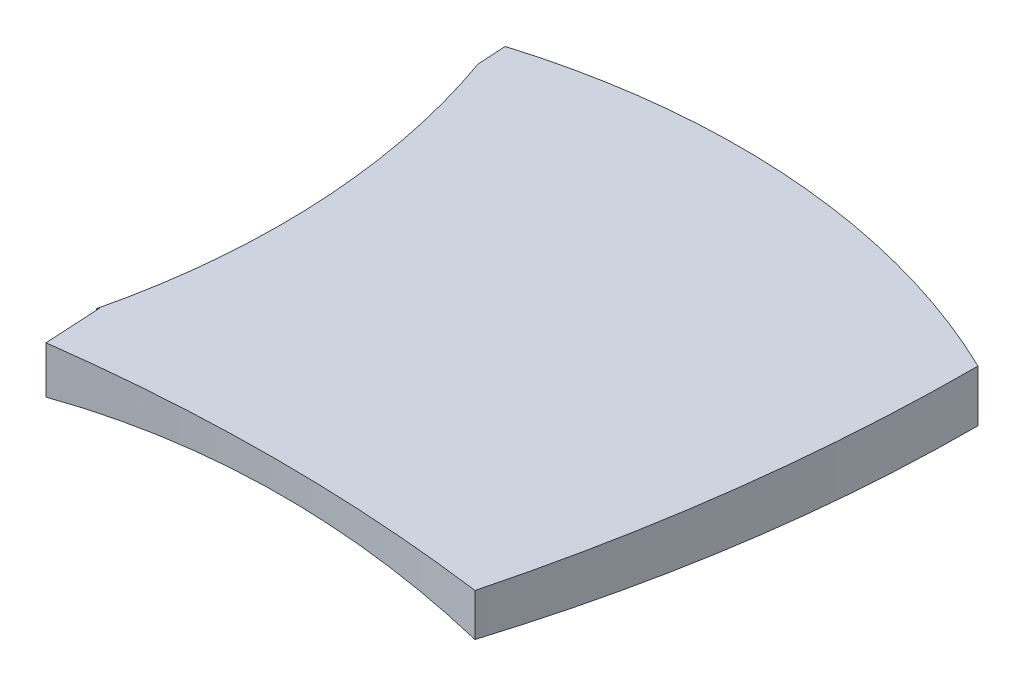
ISO-10303-21;
HEADER;
FILE_DESCRIPTION(('STEP AP214'),'2;1');
FILE_NAME('part.step','',(''),(''),'','','');
FILE_SCHEMA(('AUTOMOTIVE_DESIGN { 1 0 10303 214 1 1 1 1 }'));
ENDSEC;
DATA;
#1=APPLICATION_CONTEXT('core data for automotive mechanical design processes');
#2=APPLICATION_PROTOCOL_DEFINITION('international standard','automotive_design',2000,#1);
#3=PRODUCT_CONTEXT('',#1,'mechanical');
#4=PRODUCT('Part','Part','',(#3));
#5=PRODUCT_RELATED_PRODUCT_CATEGORY('part','',(#4));
#6=PRODUCT_DEFINITION_FORMATION('','',#4);
#7=PRODUCT_DEFINITION_CONTEXT('part definition',#1,'design');
#8=PRODUCT_DEFINITION('design','',#6,#7);
#9=PRODUCT_DEFINITION_SHAPE('','',#8);
#10=(LENGTH_UNIT() NAMED_UNIT(*) SI_UNIT(.MILLI.,.METRE.));
#11=(NAMED_UNIT(*) PLANE_ANGLE_UNIT() SI_UNIT($,.RADIAN.));
#12=(NAMED_UNIT(*) SI_UNIT($,.STERADIAN.) SOLID_ANGLE_UNIT());
#13=UNCERTAINTY_MEASURE_WITH_UNIT(LENGTH_MEASURE(1.E-05),#10,'distance_accuracy_value','');
#14=(GEOMETRIC_REPRESENTATION_CONTEXT(3) GLOBAL_UNCERTAINTY_ASSIGNED_CONTEXT((#13)) GLOBAL_UNIT_ASSIGNED_CONTEXT((#10,
#11,#12)) REPRESENTATION_CONTEXT('',''));
#15=CARTESIAN_POINT('',(0.,0.,0.));
#16=DIRECTION('',(0.,0.,1.));
#17=DIRECTION('',(1.,0.,0.));
#18=AXIS2_PLACEMENT_3D('',#15,#16,#17);
#19=CARTESIAN_POINT('',(-8.88859647248739,15.,78.1610309840222));
#20=DIRECTION('',(0.,-1.,0.));
#21=DIRECTION('',(0.,0.,-1.));
#22=AXIS2_PLACEMENT_3D('',#19,#20,#21);
#23=CYLINDRICAL_SURFACE('',#22,123.482500582783);
#24=DIRECTION('',(0.,-1.,0.));
#25=VECTOR('',#24,1.);
#26=CARTESIAN_POINT('',(45.,15.,-32.94228634));
#27=LINE('',#26,#25);
#28=CARTESIAN_POINT('',(45.,15.,-32.94228634));
#29=VERTEX_POINT('',#28);
#30=CARTESIAN_POINT('',(45.,5.96034980827603,-32.94228634));
#31=VERTEX_POINT('',#30);
#32=EDGE_CURVE('E61',#29,#31,#27,.T.);
#33=ORIENTED_EDGE('',*,*,#32,.T.);
#34=CARTESIAN_POINT('',(45.0000000000001,5.96034980827603,-32.9422863399999));
#35=CARTESIAN_POINT('',(43.5834184027266,6.21759089851168,-33.6293930770997));
#36=CARTESIAN_POINT('',(42.1521862624013,6.46486537990787,-34.2900995016351));
#37=CARTESIAN_POINT('',(39.2624221339613,6.93794334408272,-35.5574614845578));
#38=CARTESIAN_POINT('',(37.8038888298308,7.16374578862426,-36.1641144292087));
#39=CARTESIAN_POINT('',(34.8611849596405,7.59238606599919,-37.3222398739577));
#40=CARTESIAN_POINT('',(33.3770062513949,7.79521644505457,-37.8736944570605));
#41=CARTESIAN_POINT('',(30.3857431614198,8.17640697778323,-38.9199865031664));
#42=CARTESIAN_POINT('',(28.8786591219798,8.35476749672716,-39.4148248112834));
#43=CARTESIAN_POINT('',(25.8436086723789,8.68575380049673,-40.3468695304469));
#44=CARTESIAN_POINT('',(24.3156377636434,8.83837394390338,-40.7840633031927));
#45=CARTESIAN_POINT('',(21.2416607026515,9.11666250857526,-41.5996643493418));
#46=CARTESIAN_POINT('',(19.6956546672255,9.24233110432875,-41.9780720033307));
#47=CARTESIAN_POINT('',(16.5884586815512,9.46568095669588,-42.6751489159118));
#48=CARTESIAN_POINT('',(15.0272709605506,9.56336626002556,-42.9938268098292));
#49=CARTESIAN_POINT('',(11.8922389764383,9.72991442741941,-43.5707443499898));
#50=CARTESIAN_POINT('',(10.3183947329082,9.79877733606732,-43.828984089721));
#51=CARTESIAN_POINT('',(7.15692538656263,9.90712943630176,-44.28498266808));
#52=CARTESIAN_POINT('',(5.56927562698411,9.94654455599515,-44.4825882597486));
#53=CARTESIAN_POINT('',(2.38703172076932,9.99520802477806,-44.8159897098799));
#54=CARTESIAN_POINT('',(0.792437554504641,10.0044562885453,-44.951785393522));
#55=CARTESIAN_POINT('',(-2.40094571078764,9.99246607010314,-45.1613072592102));
#56=CARTESIAN_POINT('',(-3.99973539167413,9.97122310891308,-45.2350243197495));
#57=CARTESIAN_POINT('',(-7.19825941513917,9.89811827175419,-45.3202637315361));
#58=CARTESIAN_POINT('',(-8.79799375008211,9.84625663998028,-45.331786578797));
#59=CARTESIAN_POINT('',(-11.9928476167967,9.71209437724928,-45.2927645711794));
#60=CARTESIAN_POINT('',(-13.5879704329366,9.62984281819862,-45.2423194749529));
#61=CARTESIAN_POINT('',(-16.7732279795333,9.43515479737612,-45.079804799253));
#62=CARTESIAN_POINT('',(-18.3633626994491,9.32271827185978,-44.9677350896405));
#63=CARTESIAN_POINT('',(-21.5351662912063,9.06815937039632,-44.6824743319111));
#64=CARTESIAN_POINT('',(-23.1168379881184,8.92604762865556,-44.509305163686));
#65=CARTESIAN_POINT('',(-26.2693237946828,8.61275984678985,-44.1024706485254));
#66=CARTESIAN_POINT('',(-27.8401390508661,8.44158692613125,-43.8688117932235));
#67=CARTESIAN_POINT('',(-30.7042295618369,8.10226535861564,-43.3862614918821));
#68=CARTESIAN_POINT('',(-31.9995897078062,7.93848480453971,-43.1466012598251));
#69=CARTESIAN_POINT('',(-34.579245838651,7.59198342139258,-42.6265896793619));
#70=CARTESIAN_POINT('',(-35.8635443987258,7.40926713724706,-42.3462480887991));
#71=CARTESIAN_POINT('',(-38.4181630091545,7.02574071618074,-41.7458152555257));
#72=CARTESIAN_POINT('',(-39.6884999616528,6.82495599952256,-41.4257796251628));
#73=CARTESIAN_POINT('',(-42.2159227228687,6.40572266400367,-40.7462048880602));
#74=CARTESIAN_POINT('',(-43.4730056308963,6.18727026563824,-40.3866573229174));
#75=CARTESIAN_POINT('',(-44.7226499018874,5.96034980827605,-40.0076982339729));
#76=B_SPLINE_CURVE_WITH_KNOTS('',3,(#34,#35,#36,#37,#38,#39,#40,#41,#42,#43,#44,#45,#46,#47,#48,
#49,#50,#51,#52,#53,#54,#55,#56,#57,#58,#59,#60,#61,#62,#63,#64,#65,#66,#67,#68,#69,#70,#71,#72,
#73,#74,#75),.UNSPECIFIED.,.F.,.F.,(4,2,2,2,2,2,2,2,2,2,2,2,2,2,2,2,2,2,2,2,4),(0.,
4.78563990280232,9.57151108804908,14.3589307294615,19.1462788995123,23.9346749346072,
28.7230399679908,33.5107121970209,38.2983770202414,43.0980443867058,47.8977253282744,
52.6981113867506,57.4984591609385,62.2910892465061,67.0837294532122,71.8746551406764,
76.6650668884523,80.6467447498242,84.6274691385028,88.6026781296248,92.5787397659509),.UNSPECIFIED.);
#77=CARTESIAN_POINT('',(-44.7226499018874,5.96034980827605,-40.0076982339729));
#78=VERTEX_POINT('',#77);
#79=EDGE_CURVE('E55',#31,#78,#76,.T.);
#80=ORIENTED_EDGE('',*,*,#79,.T.);
#81=DIRECTION('',(0.,-1.,0.));
#82=VECTOR('',#81,1.);
#83=CARTESIAN_POINT('',(-44.7226499018874,15.,-40.0076982339729));
#84=LINE('',#83,#82);
#85=CARTESIAN_POINT('',(-44.7226499018874,15.,-40.0076982339729));
#86=VERTEX_POINT('',#85);
#87=EDGE_CURVE('E48',#86,#78,#84,.T.);
#88=ORIENTED_EDGE('',*,*,#87,.F.);
#89=CARTESIAN_POINT('',(-8.88859647248739,15.,78.1610309840222));
#90=DIRECTION('',(0.,1.,0.));
#91=DIRECTION('',(0.,0.,1.));
#92=AXIS2_PLACEMENT_3D('',#89,#90,#91);
#93=CIRCLE('',#92,123.482500582783);
#94=EDGE_CURVE('E136',#86,#29,#93,.F.);
#95=ORIENTED_EDGE('',*,*,#94,.T.);
#96=EDGE_LOOP('',(#33,#80,#88,#95));
#97=FACE_BOUND('',#96,.T.);
#98=ADVANCED_FACE('F35',(#97),#23,.T.);
#99=CARTESIAN_POINT('',(-161.502511631079,15.,6.42411191590333));
#100=DIRECTION('',(0.,-1.,0.));
#101=DIRECTION('',(0.,0.,-1.));
#102=AXIS2_PLACEMENT_3D('',#99,#100,#101);
#103=CYLINDRICAL_SURFACE('',#102,124.175777412012);
#104=CARTESIAN_POINT('',(-40.751707535483,6.64851495333721,35.3873128119449));
#105=CARTESIAN_POINT('',(-40.3454791079022,6.71552788724556,33.6938164920931));
#106=CARTESIAN_POINT('',(-39.9748684951334,6.77570118535622,31.9915127317589));
#107=CARTESIAN_POINT('',(-39.3055042222609,6.88311320991459,28.5724265440764));
#108=CARTESIAN_POINT('',(-39.0067507105147,6.93035190965731,26.8556440868426));
#109=CARTESIAN_POINT('',(-38.4816905357321,7.01264435609367,23.4105264939112));
#110=CARTESIAN_POINT('',(-38.2553930148108,7.047696565208,21.6821899284411));
#111=CARTESIAN_POINT('',(-37.8757323397577,7.1061418802066,18.2173428444478));
#112=CARTESIAN_POINT('',(-37.7223685028406,7.1295350952393,16.4808324025999));
#113=CARTESIAN_POINT('',(-37.4916646359926,7.16461103724071,13.0443735088038));
#114=CARTESIAN_POINT('',(-37.4125944317713,7.1765604070676,11.3445436841447));
#115=CARTESIAN_POINT('',(-37.3243689704385,7.18988813608187,7.9430308049136));
#116=CARTESIAN_POINT('',(-37.3152136747447,7.19126650110281,6.24134775136485));
#117=CARTESIAN_POINT('',(-37.3668320510273,7.18347501206954,2.8394351493237));
#118=CARTESIAN_POINT('',(-37.4275901114626,7.17430751289013,1.13920536114563));
#119=CARTESIAN_POINT('',(-37.6188838721133,7.14528649942918,-2.2571056568911));
#120=CARTESIAN_POINT('',(-37.7494162375339,7.12543349585056,-3.95318708112522));
#121=CARTESIAN_POINT('',(-38.1570245138622,7.06294761564648,-8.12672052021377));
#122=CARTESIAN_POINT('',(-38.4740344334491,7.01401213155563,-10.6002779714223));
#123=CARTESIAN_POINT('',(-39.2561951797939,6.89102623491641,-15.5229028964115));
#124=CARTESIAN_POINT('',(-39.7213229235241,6.81697973561062,-17.9719741248851));
#125=CARTESIAN_POINT('',(-40.5334227809356,6.68459640309395,-21.6420905795143));
#126=CARTESIAN_POINT('',(-40.8262862245682,6.63639558090477,-22.8757081019472));
#127=CARTESIAN_POINT('',(-41.4495770020546,6.53252651908165,-25.3331421207452));
#128=CARTESIAN_POINT('',(-41.7800042670181,6.47685829314251,-26.5569586350805));
#129=CARTESIAN_POINT('',(-42.4781318011911,6.35764386723105,-28.9937841829342));
#130=CARTESIAN_POINT('',(-42.8458395714261,6.29409608127567,-30.2067909878593));
#131=CARTESIAN_POINT('',(-43.6180650162945,6.15867798671936,-32.6205688236822));
#132=CARTESIAN_POINT('',(-44.0225829102179,6.08680762853741,-33.8213397816396));
#133=CARTESIAN_POINT('',(-44.4452998037748,6.01054966249482,-35.0153964679459));
#134=B_SPLINE_CURVE_WITH_KNOTS('',3,(#104,#105,#106,#107,#108,#109,#110,#111,#112,#113,#114,
#115,#116,#117,#118,#119,#120,#121,#122,#123,#124,#125,#126,#127,#128,#129,#130,#131,#132,#133),
.UNSPECIFIED.,.F.,.F.,(4,2,2,2,2,2,2,2,2,2,2,2,2,2,4),(0.,5.22806957179798,10.4561499374763,
15.6848896950683,20.9135805016562,26.0172440741566,31.1209048302297,36.2234261681152,
41.3257036577853,48.8037197000283,56.2805709206411,60.0865173471809,63.8924567939239,
67.6991635403379,71.5058929660485),.UNSPECIFIED.);
#135=CARTESIAN_POINT('',(-40.751707535483,6.6485149533372,35.3873128119449));
#136=VERTEX_POINT('',#135);
#137=CARTESIAN_POINT('',(-44.4452998037748,6.01054966249481,-35.0153964679459));
#138=VERTEX_POINT('',#137);
#139=EDGE_CURVE('E139',#136,#138,#134,.T.);
#140=ORIENTED_EDGE('',*,*,#139,.F.);
#141=DIRECTION('',(0.,-1.,0.));
#142=VECTOR('',#141,1.);
#143=CARTESIAN_POINT('',(-40.751707535483,15.,35.3873128119449));
#144=LINE('',#143,#142);
#145=CARTESIAN_POINT('',(-40.751707535483,15.,35.3873128119449));
#146=VERTEX_POINT('',#145);
#147=EDGE_CURVE('E121',#146,#136,#144,.T.);
#148=ORIENTED_EDGE('',*,*,#147,.F.);
#149=CARTESIAN_POINT('',(-161.502511631079,15.,6.42411191590333));
#150=DIRECTION('',(0.,1.,0.));
#151=DIRECTION('',(0.,0.,1.));
#152=AXIS2_PLACEMENT_3D('',#149,#150,#151);
#153=CIRCLE('',#152,124.175777412012);
#154=CARTESIAN_POINT('',(-44.4452998037748,15.,-35.0153964679459));
#155=VERTEX_POINT('',#154);
#156=EDGE_CURVE('E240',#155,#146,#153,.F.);
#157=ORIENTED_EDGE('',*,*,#156,.F.);
#158=DIRECTION('',(0.,-1.,0.));
#159=VECTOR('',#158,1.);
#160=CARTESIAN_POINT('',(-44.4452998037748,15.,-35.0153964679459));
#161=LINE('',#160,#159);
#162=EDGE_CURVE('E124',#155,#138,#161,.T.);
#163=ORIENTED_EDGE('',*,*,#162,.T.);
#164=EDGE_LOOP('',(#140,#148,#157,#163));
#165=FACE_BOUND('',#164,.T.);
#166=ADVANCED_FACE('F164',(#165),#103,.F.);
#167=CARTESIAN_POINT('',(-2.50000000000003,15.,325.080054765307));
#168=DIRECTION('',(0.,-1.,0.));
#169=DIRECTION('',(0.,0.,-1.));
#170=AXIS2_PLACEMENT_3D('',#167,#168,#169);
#171=CYLINDRICAL_SURFACE('',#170,282.579346515872);
#172=CARTESIAN_POINT('',(34.9999999999999,7.56851741990913,45.));
#173=CARTESIAN_POINT('',(33.4480514933926,7.78609173589927,44.7922021832451));
#174=CARTESIAN_POINT('',(31.8924019677432,7.9893575370501,44.5970531853262));
#175=CARTESIAN_POINT('',(28.7746001157189,8.36700516707804,44.2323221549153));
#176=CARTESIAN_POINT('',(27.2124477317869,8.54138673973966,44.0627403492163));
#177=CARTESIAN_POINT('',(24.0825095684318,8.86100096191045,43.749410981182));
#178=CARTESIAN_POINT('',(22.514723584499,9.00623254211561,43.6056643665745));
#179=CARTESIAN_POINT('',(19.3745814708467,9.26731811325131,43.3442345137237));
#180=CARTESIAN_POINT('',(17.8022253569308,9.38317220564699,43.2265511854621));
#181=CARTESIAN_POINT('',(13.1109165408492,9.68437514235578,42.9149573682751));
#182=CARTESIAN_POINT('',(9.98643685289668,9.82655776353026,42.7593720439894));
#183=CARTESIAN_POINT('',(3.73111861586914,9.99402813440231,42.5520839283839));
#184=CARTESIAN_POINT('',(0.600280242787491,10.0193190764377,42.5003783001083));
#185=CARTESIAN_POINT('',(-5.66011906919772,9.95278295013716,42.5010413666191));
#186=CARTESIAN_POINT('',(-8.78968001632172,9.86095664774551,42.5534093807674));
#187=CARTESIAN_POINT('',(-15.0399516582374,9.56058083685036,42.7617716249602));
#188=CARTESIAN_POINT('',(-18.1606620974037,9.35202799080679,42.9177688180782));
#189=CARTESIAN_POINT('',(-22.8444693440308,8.95119206040345,43.229611288311));
#190=CARTESIAN_POINT('',(-24.4139989671084,8.8019478925096,43.3473152135638));
#191=CARTESIAN_POINT('',(-27.5478786938158,8.47418458375137,43.6086303090888));
#192=CARTESIAN_POINT('',(-29.1122287784966,8.29566533590599,43.7522415740353));
#193=CARTESIAN_POINT('',(-32.2346886885785,7.90960013308697,44.0651137564772));
#194=CARTESIAN_POINT('',(-33.7927987798422,7.70205542860885,44.2343735689897));
#195=CARTESIAN_POINT('',(-36.9019338079127,7.25822065524086,44.598246505109));
#196=CARTESIAN_POINT('',(-38.4529588129962,7.02193086396752,44.7928593838603));
#197=CARTESIAN_POINT('',(-40.0000000000001,6.77141009874151,45.));
#198=B_SPLINE_CURVE_WITH_KNOTS('',3,(#172,#173,#174,#175,#176,#177,#178,#179,#180,#181,#182,
#183,#184,#185,#186,#187,#188,#189,#190,#191,#192,#193,#194,#195,#196,#197),.UNSPECIFIED.,.F.,
.F.,(4,2,2,2,2,2,2,2,2,2,2,2,4),(0.,4.74240726511443,9.48485659516254,14.2274798598552,
18.9700867440613,28.3605931267849,37.7508430511717,47.1410315638423,56.5314885821201,
61.2740748691628,66.0166784876019,70.7590778447033,75.5014314039277),.UNSPECIFIED.);
#199=CARTESIAN_POINT('',(35.,7.5685174199091,45.));
#200=VERTEX_POINT('',#199);
#201=CARTESIAN_POINT('',(-40.0000000000001,6.77141009874149,45.));
#202=VERTEX_POINT('',#201);
#203=EDGE_CURVE('E98',#200,#202,#198,.T.);
#204=ORIENTED_EDGE('',*,*,#203,.F.);
#205=DIRECTION('',(0.,-1.,0.));
#206=VECTOR('',#205,1.);
#207=CARTESIAN_POINT('',(34.9999999999999,15.,45.));
#208=LINE('',#207,#206);
#209=CARTESIAN_POINT('',(34.9999999999999,15.,45.));
#210=VERTEX_POINT('',#209);
#211=EDGE_CURVE('E106',#210,#200,#208,.T.);
#212=ORIENTED_EDGE('',*,*,#211,.F.);
#213=CARTESIAN_POINT('',(-2.50000000000003,15.,325.080054765307));
#214=DIRECTION('',(0.,1.,0.));
#215=DIRECTION('',(0.,0.,1.));
#216=AXIS2_PLACEMENT_3D('',#213,#214,#215);
#217=CIRCLE('',#216,282.579346515872);
#218=CARTESIAN_POINT('',(-40.,15.,45.));
#219=VERTEX_POINT('',#218);
#220=EDGE_CURVE('E231',#219,#210,#217,.F.);
#221=ORIENTED_EDGE('',*,*,#220,.F.);
#222=DIRECTION('',(0.,-1.,0.));
#223=VECTOR('',#222,1.);
#224=CARTESIAN_POINT('',(-40.,15.,45.));
#225=LINE('',#224,#223);
#226=EDGE_CURVE('E107',#219,#202,#225,.T.);
#227=ORIENTED_EDGE('',*,*,#226,.T.);
#228=EDGE_LOOP('',(#204,#212,#221,#227));
#229=FACE_BOUND('',#228,.T.);
#230=ADVANCED_FACE('F104',(#229),#171,.F.);
#231=CARTESIAN_POINT('',(-265.002672468251,15.,-33.1030042932121));
#232=DIRECTION('',(0.,-1.,0.));
#233=DIRECTION('',(0.,0.,-1.));
#234=AXIS2_PLACEMENT_3D('',#231,#232,#233);
#235=CYLINDRICAL_SURFACE('',#234,310.0027141296);
#236=ORIENTED_EDGE('',*,*,#211,.T.);
#237=CARTESIAN_POINT('',(35.,7.5685174199091,45.));
#238=CARTESIAN_POINT('',(35.4142712643396,7.51043803071517,43.4087353787034));
#239=CARTESIAN_POINT('',(35.8158813976437,7.45308383953003,41.8141775454784));
#240=CARTESIAN_POINT('',(36.5936934093088,7.34019696087686,38.6188112097332));
#241=CARTESIAN_POINT('',(36.9698952643796,7.28466427507852,37.0180027014848));
#242=CARTESIAN_POINT('',(38.0602390640555,7.12135818034769,32.2067941423593));
#243=CARTESIAN_POINT('',(38.7361411984416,7.01687361797635,28.9875267234188));
#244=CARTESIAN_POINT('',(39.9826348679029,6.81975330992735,22.5420827421456));
#245=CARTESIAN_POINT('',(40.5536471169192,6.72707070717,19.3159887241721));
#246=CARTESIAN_POINT('',(41.593177971818,6.55530987792046,12.8469602129279));
#247=CARTESIAN_POINT('',(42.0616968800053,6.47623161130233,9.60402576935702));
#248=CARTESIAN_POINT('',(42.8957367980651,6.33355672130836,3.10455231562362));
#249=CARTESIAN_POINT('',(43.2612564195508,6.26996030662287,-0.151986877324742));
#250=CARTESIAN_POINT('',(43.8888873329667,6.15972967098949,-6.67528938943269));
#251=CARTESIAN_POINT('',(44.1509985606544,6.11309546057933,-9.94205271494272));
#252=CARTESIAN_POINT('',(44.572385127449,6.03770668362165,-16.4959835487032));
#253=CARTESIAN_POINT('',(44.7312326759525,6.00902651322772,-19.7831796920495));
#254=CARTESIAN_POINT('',(44.890948963646,5.98013122070275,-24.7164858254692));
#255=CARTESIAN_POINT('',(44.9310952369894,5.97285361291864,-26.3613714630299));
#256=CARTESIAN_POINT('',(44.9851942446728,5.96303865351313,-29.6515879630775));
#257=CARTESIAN_POINT('',(44.9991469724229,5.96050130308427,-31.2969188256763));
#258=CARTESIAN_POINT('',(45.,5.96034980827608,-32.94228634));
#259=B_SPLINE_CURVE_WITH_KNOTS('',3,(#237,#238,#239,#240,#241,#242,#243,#244,#245,#246,#247,
#248,#249,#250,#251,#252,#253,#254,#255,#256,#257,#258),.UNSPECIFIED.,.F.,.F.,(4,2,2,2,2,2,2,2,
2,2,4),(0.,4.93588624192249,9.8717770082335,19.743297060102,29.5743139584333,39.4053018597191,
49.2364222722046,59.0675487922491,68.9391474895501,73.8751363884132,78.8111265290605),.UNSPECIFIED.);
#260=EDGE_CURVE('E11',#200,#31,#259,.T.);
#261=ORIENTED_EDGE('',*,*,#260,.T.);
#262=ORIENTED_EDGE('',*,*,#32,.F.);
#263=CARTESIAN_POINT('',(-265.002672468251,15.,-33.1030042932121));
#264=DIRECTION('',(0.,1.,0.));
#265=DIRECTION('',(0.,0.,1.));
#266=AXIS2_PLACEMENT_3D('',#263,#264,#265);
#267=CIRCLE('',#266,310.0027141296);
#268=EDGE_CURVE('E112',#29,#210,#267,.F.);
#269=ORIENTED_EDGE('',*,*,#268,.T.);
#270=EDGE_LOOP('',(#236,#261,#262,#269));
#271=FACE_BOUND('',#270,.T.);
#272=ADVANCED_FACE('F110',(#271),#235,.T.);
#273=CARTESIAN_POINT('',(-42.3692307692307,15.,2.35384615384618));
#274=DIRECTION('',(0.998460353205412,0.,-0.0554700196225235));
#275=DIRECTION('',(-0.0554700196225235,0.,-0.998460353205412));
#276=AXIS2_PLACEMENT_3D('',#273,#274,#275);
#277=PLANE('',#276);
#278=CARTESIAN_POINT('',(0.138675049056328,-241.103541481268,767.496150883005));
#279=DIRECTION('',(0.998460353205412,0.,-0.0554700196225235));
#280=DIRECTION('',(-0.0554700196225235,0.,-0.998460353205412));
#281=AXIS2_PLACEMENT_3D('',#278,#279,#280);
#282=ELLIPSE('',#281,4526.83764652902,251.103773080943);
#283=EDGE_CURVE('E132',#138,#78,#282,.F.);
#284=ORIENTED_EDGE('',*,*,#283,.F.);
#285=ORIENTED_EDGE('',*,*,#162,.F.);
#286=DIRECTION('',(0.0554700196225235,0.,0.998460353205412));
#287=VECTOR('',#286,1.);
#288=CARTESIAN_POINT('',(-42.3692307692307,15.,2.35384615384618));
#289=LINE('',#288,#287);
#290=EDGE_CURVE('E133',#86,#155,#289,.T.);
#291=ORIENTED_EDGE('',*,*,#290,.F.);
#292=ORIENTED_EDGE('',*,*,#87,.T.);
#293=EDGE_LOOP('',(#284,#285,#291,#292));
#294=FACE_BOUND('',#293,.T.);
#295=ADVANCED_FACE('F130',(#294),#277,.F.);
#296=CARTESIAN_POINT('',(-17.1848251831549,15.,-9.10295215461495));
#297=DIRECTION('',(0.883679372564984,0.,0.468092690076608));
#298=DIRECTION('',(0.468092690076608,0.,-0.883679372564984));
#299=AXIS2_PLACEMENT_3D('',#296,#297,#298);
#300=PLANE('',#299);
#301=ORIENTED_EDGE('',*,*,#147,.T.);
#302=CARTESIAN_POINT('',(0.138675049056328,-241.103541481268,-41.8067737274841));
#303=DIRECTION('',(0.883679372564984,0.,0.468092690076608));
#304=DIRECTION('',(0.468092690076608,0.,-0.883679372564984));
#305=AXIS2_PLACEMENT_3D('',#302,#303,#304);
#306=ELLIPSE('',#305,536.440278612014,251.103773080943);
#307=CARTESIAN_POINT('',(-40.5547001962252,6.68094969328574,35.0153964679459));
#308=VERTEX_POINT('',#307);
#309=EDGE_CURVE('E163',#136,#308,#306,.F.);
#310=ORIENTED_EDGE('',*,*,#309,.T.);
#311=DIRECTION('',(0.,-1.,0.));
#312=VECTOR('',#311,1.);
#313=CARTESIAN_POINT('',(-40.5547001962252,15.,35.0153964679459));
#314=LINE('',#313,#312);
#315=CARTESIAN_POINT('',(-40.5547001962252,15.,35.0153964679459));
#316=VERTEX_POINT('',#315);
#317=EDGE_CURVE('E114',#316,#308,#314,.T.);
#318=ORIENTED_EDGE('',*,*,#317,.F.);
#319=DIRECTION('',(-0.468092690076609,0.,0.883679372564984));
#320=VECTOR('',#319,1.);
#321=CARTESIAN_POINT('',(-17.1848251831549,15.,-9.10295215461495));
#322=LINE('',#321,#320);
#323=EDGE_CURVE('E237',#316,#146,#322,.T.);
#324=ORIENTED_EDGE('',*,*,#323,.T.);
#325=EDGE_LOOP('',(#301,#310,#318,#324));
#326=FACE_BOUND('',#325,.T.);
#327=ADVANCED_FACE('F169',(#326),#300,.T.);
#328=CARTESIAN_POINT('',(-42.3692307692308,15.,2.35384615384615));
#329=DIRECTION('',(-0.998460353205412,0.,0.0554700196225229));
#330=DIRECTION('',(0.0554700196225229,0.,0.998460353205412));
#331=AXIS2_PLACEMENT_3D('',#328,#329,#330);
#332=PLANE('',#331);
#333=ORIENTED_EDGE('',*,*,#317,.T.);
#334=CARTESIAN_POINT('',(0.138675049056328,-241.103541481268,767.496150883015));
#335=DIRECTION('',(-0.998460353205412,0.,0.0554700196225229));
#336=DIRECTION('',(-0.0554700196225229,0.,-0.998460353205413));
#337=AXIS2_PLACEMENT_3D('',#334,#335,#336);
#338=ELLIPSE('',#337,4526.83764652908,251.103773080943);
#339=EDGE_CURVE('E108',#308,#202,#338,.F.);
#340=ORIENTED_EDGE('',*,*,#339,.T.);
#341=ORIENTED_EDGE('',*,*,#226,.F.);
#342=DIRECTION('',(-0.0554700196225229,0.,-0.998460353205413));
#343=VECTOR('',#342,1.);
#344=CARTESIAN_POINT('',(-42.3692307692308,15.,2.35384615384615));
#345=LINE('',#344,#343);
#346=EDGE_CURVE('E232',#219,#316,#345,.T.);
#347=ORIENTED_EDGE('',*,*,#346,.T.);
#348=EDGE_LOOP('',(#333,#340,#341,#347));
#349=FACE_BOUND('',#348,.T.);
#350=ADVANCED_FACE('F176',(#349),#332,.T.);
#351=CARTESIAN_POINT('',(0.,15.,0.));
#352=DIRECTION('',(0.,1.,0.));
#353=DIRECTION('',(0.,0.,1.));
#354=AXIS2_PLACEMENT_3D('',#351,#352,#353);
#355=PLANE('',#354);
#356=ORIENTED_EDGE('',*,*,#94,.F.);
#357=ORIENTED_EDGE('',*,*,#290,.T.);
#358=ORIENTED_EDGE('',*,*,#156,.T.);
#359=ORIENTED_EDGE('',*,*,#323,.F.);
#360=ORIENTED_EDGE('',*,*,#346,.F.);
#361=ORIENTED_EDGE('',*,*,#220,.T.);
#362=ORIENTED_EDGE('',*,*,#268,.F.);
#363=EDGE_LOOP('',(#356,#357,#358,#359,#360,#361,#362));
#364=FACE_BOUND('',#363,.T.);
#365=ADVANCED_FACE('F149',(#364),#355,.T.);
#366=CARTESIAN_POINT('',(0.138675049056328,-241.103541481268,58.));
#367=DIRECTION('',(0.,0.,-1.));
#368=DIRECTION('',(-1.,0.,0.));
#369=AXIS2_PLACEMENT_3D('',#366,#367,#368);
#370=CYLINDRICAL_SURFACE('',#369,251.103773080943);
#371=ORIENTED_EDGE('',*,*,#260,.F.);
#372=ORIENTED_EDGE('',*,*,#203,.T.);
#373=ORIENTED_EDGE('',*,*,#339,.F.);
#374=ORIENTED_EDGE('',*,*,#309,.F.);
#375=ORIENTED_EDGE('',*,*,#139,.T.);
#376=ORIENTED_EDGE('',*,*,#283,.T.);
#377=ORIENTED_EDGE('',*,*,#79,.F.);
#378=EDGE_LOOP('',(#371,#372,#373,#374,#375,#376,#377));
#379=FACE_BOUND('',#378,.T.);
#380=ADVANCED_FACE('F97',(#379),#370,.F.);
#381=CLOSED_SHELL('',(#98,#166,#230,#272,#295,#327,#350,#365,#380));
#382=MANIFOLD_SOLID_BREP('B2',#381);
#383=ADVANCED_BREP_SHAPE_REPRESENTATION('',(#18,#382),#14);
#384=SHAPE_DEFINITION_REPRESENTATION(#9,#383);
ENDSEC;
END-ISO-10303-21;
